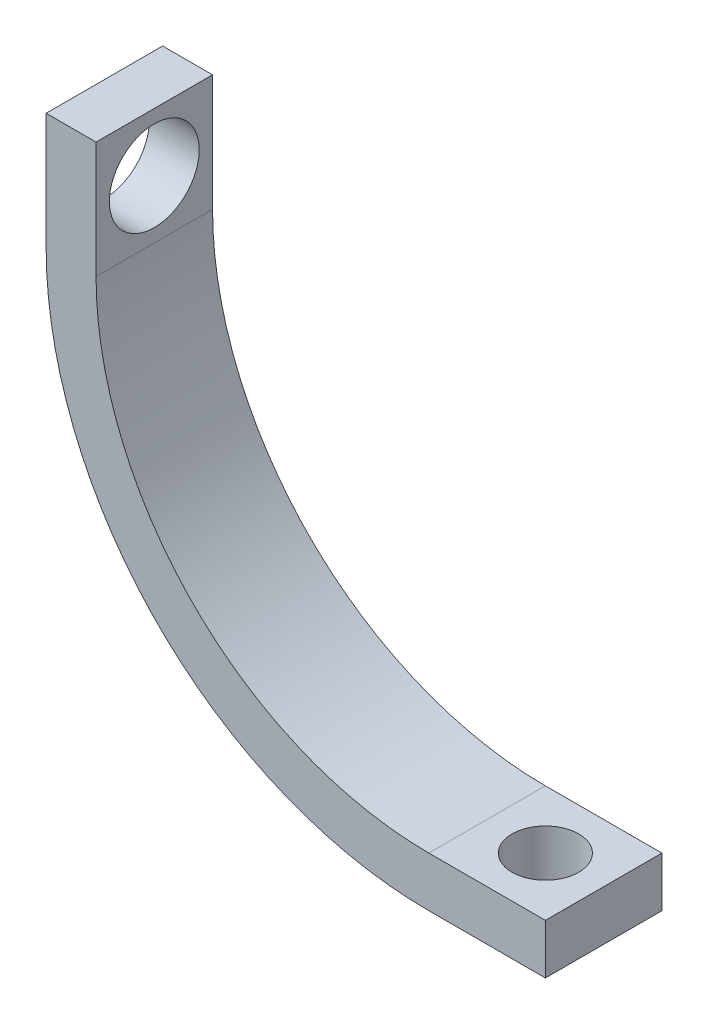
ISO-10303-21;
HEADER;
FILE_DESCRIPTION(('STEP AP214'),'2;1');
FILE_NAME('part.step','',(''),(''),'','','');
FILE_SCHEMA(('AUTOMOTIVE_DESIGN { 1 0 10303 214 1 1 1 1 }'));
ENDSEC;
DATA;
#1=APPLICATION_CONTEXT('core data for automotive mechanical design processes');
#2=APPLICATION_PROTOCOL_DEFINITION('international standard','automotive_design',2000,#1);
#3=PRODUCT_CONTEXT('',#1,'mechanical');
#4=PRODUCT('Part','Part','',(#3));
#5=PRODUCT_RELATED_PRODUCT_CATEGORY('part','',(#4));
#6=PRODUCT_DEFINITION_FORMATION('','',#4);
#7=PRODUCT_DEFINITION_CONTEXT('part definition',#1,'design');
#8=PRODUCT_DEFINITION('design','',#6,#7);
#9=PRODUCT_DEFINITION_SHAPE('','',#8);
#10=(LENGTH_UNIT() NAMED_UNIT(*) SI_UNIT(.MILLI.,.METRE.));
#11=(NAMED_UNIT(*) PLANE_ANGLE_UNIT() SI_UNIT($,.RADIAN.));
#12=(NAMED_UNIT(*) SI_UNIT($,.STERADIAN.) SOLID_ANGLE_UNIT());
#13=UNCERTAINTY_MEASURE_WITH_UNIT(LENGTH_MEASURE(1.E-05),#10,'distance_accuracy_value','');
#14=(GEOMETRIC_REPRESENTATION_CONTEXT(3) GLOBAL_UNCERTAINTY_ASSIGNED_CONTEXT((#13)) GLOBAL_UNIT_ASSIGNED_CONTEXT((#10,
#11,#12)) REPRESENTATION_CONTEXT('',''));
#15=CARTESIAN_POINT('',(0.,0.,0.));
#16=DIRECTION('',(0.,0.,1.));
#17=DIRECTION('',(1.,0.,0.));
#18=AXIS2_PLACEMENT_3D('',#15,#16,#17);
#19=CARTESIAN_POINT('',(0.,0.,7.));
#20=DIRECTION('',(0.,0.,-1.));
#21=DIRECTION('',(-1.,0.,0.));
#22=AXIS2_PLACEMENT_3D('',#19,#20,#21);
#23=CYLINDRICAL_SURFACE('',#22,20.);
#24=CARTESIAN_POINT('',(0.,0.,0.));
#25=DIRECTION('',(0.,0.,-1.));
#26=DIRECTION('',(1.,0.,0.));
#27=AXIS2_PLACEMENT_3D('',#24,#25,#26);
#28=CIRCLE('',#27,20.);
#29=CARTESIAN_POINT('',(0.,-20.,0.));
#30=VERTEX_POINT('',#29);
#31=CARTESIAN_POINT('',(-20.,0.,0.));
#32=VERTEX_POINT('',#31);
#33=EDGE_CURVE('E128',#30,#32,#28,.T.);
#34=ORIENTED_EDGE('',*,*,#33,.T.);
#35=DIRECTION('',(0.,0.,-1.));
#36=VECTOR('',#35,1.);
#37=CARTESIAN_POINT('',(-20.,0.,7.));
#38=LINE('',#37,#36);
#39=CARTESIAN_POINT('',(-20.,0.,7.));
#40=VERTEX_POINT('',#39);
#41=EDGE_CURVE('E11',#40,#32,#38,.T.);
#42=ORIENTED_EDGE('',*,*,#41,.F.);
#43=CARTESIAN_POINT('',(0.,0.,7.));
#44=DIRECTION('',(0.,0.,-1.));
#45=DIRECTION('',(1.,0.,0.));
#46=AXIS2_PLACEMENT_3D('',#43,#44,#45);
#47=CIRCLE('',#46,20.);
#48=CARTESIAN_POINT('',(0.,-20.,7.));
#49=VERTEX_POINT('',#48);
#50=EDGE_CURVE('E143',#49,#40,#47,.T.);
#51=ORIENTED_EDGE('',*,*,#50,.F.);
#52=DIRECTION('',(0.,0.,-1.));
#53=VECTOR('',#52,1.);
#54=CARTESIAN_POINT('',(0.,-20.,7.));
#55=LINE('',#54,#53);
#56=EDGE_CURVE('E124',#49,#30,#55,.T.);
#57=ORIENTED_EDGE('',*,*,#56,.T.);
#58=EDGE_LOOP('',(#34,#42,#51,#57));
#59=FACE_BOUND('',#58,.T.);
#60=ADVANCED_FACE('F32',(#59),#23,.F.);
#61=CARTESIAN_POINT('',(-20.,0.,7.));
#62=DIRECTION('',(-1.,0.,0.));
#63=DIRECTION('',(0.,0.,1.));
#64=AXIS2_PLACEMENT_3D('',#61,#62,#63);
#65=PLANE('',#64);
#66=CARTESIAN_POINT('',(-20.,3.5,3.5));
#67=DIRECTION('',(1.,0.,0.));
#68=DIRECTION('',(0.,0.,-1.));
#69=AXIS2_PLACEMENT_3D('',#66,#67,#68);
#70=CIRCLE('',#69,2.7);
#71=CARTESIAN_POINT('',(-20.,3.5,0.8));
#72=VERTEX_POINT('',#71);
#73=EDGE_CURVE('E176',#72,#72,#70,.T.);
#74=ORIENTED_EDGE('',*,*,#73,.F.);
#75=EDGE_LOOP('',(#74));
#76=FACE_BOUND('',#75,.T.);
#77=DIRECTION('',(0.,1.,0.));
#78=VECTOR('',#77,1.);
#79=CARTESIAN_POINT('',(-20.,0.,0.));
#80=LINE('',#79,#78);
#81=CARTESIAN_POINT('',(-20.,7.,0.));
#82=VERTEX_POINT('',#81);
#83=EDGE_CURVE('E131',#32,#82,#80,.T.);
#84=ORIENTED_EDGE('',*,*,#83,.T.);
#85=DIRECTION('',(0.,0.,-1.));
#86=VECTOR('',#85,1.);
#87=CARTESIAN_POINT('',(-20.,7.,7.));
#88=LINE('',#87,#86);
#89=CARTESIAN_POINT('',(-20.,7.,7.));
#90=VERTEX_POINT('',#89);
#91=EDGE_CURVE('E40',#90,#82,#88,.T.);
#92=ORIENTED_EDGE('',*,*,#91,.F.);
#93=DIRECTION('',(0.,1.,0.));
#94=VECTOR('',#93,1.);
#95=CARTESIAN_POINT('',(-20.,0.,7.));
#96=LINE('',#95,#94);
#97=EDGE_CURVE('E91',#40,#90,#96,.T.);
#98=ORIENTED_EDGE('',*,*,#97,.F.);
#99=ORIENTED_EDGE('',*,*,#41,.T.);
#100=EDGE_LOOP('',(#84,#92,#98,#99));
#101=FACE_BOUND('',#100,.T.);
#102=ADVANCED_FACE('F202',(#76,#101),#65,.F.);
#103=CARTESIAN_POINT('',(-20.,7.,7.));
#104=DIRECTION('',(0.,-1.,0.));
#105=DIRECTION('',(0.,0.,-1.));
#106=AXIS2_PLACEMENT_3D('',#103,#104,#105);
#107=PLANE('',#106);
#108=DIRECTION('',(-1.,0.,0.));
#109=VECTOR('',#108,1.);
#110=CARTESIAN_POINT('',(-20.,7.,0.));
#111=LINE('',#110,#109);
#112=CARTESIAN_POINT('',(-23.,7.,0.));
#113=VERTEX_POINT('',#112);
#114=EDGE_CURVE('E134',#82,#113,#111,.T.);
#115=ORIENTED_EDGE('',*,*,#114,.T.);
#116=DIRECTION('',(0.,0.,-1.));
#117=VECTOR('',#116,1.);
#118=CARTESIAN_POINT('',(-23.,7.,7.));
#119=LINE('',#118,#117);
#120=CARTESIAN_POINT('',(-23.,7.,7.));
#121=VERTEX_POINT('',#120);
#122=EDGE_CURVE('E150',#121,#113,#119,.T.);
#123=ORIENTED_EDGE('',*,*,#122,.F.);
#124=DIRECTION('',(-1.,0.,0.));
#125=VECTOR('',#124,1.);
#126=CARTESIAN_POINT('',(-20.,7.,7.));
#127=LINE('',#126,#125);
#128=EDGE_CURVE('E158',#90,#121,#127,.T.);
#129=ORIENTED_EDGE('',*,*,#128,.F.);
#130=ORIENTED_EDGE('',*,*,#91,.T.);
#131=EDGE_LOOP('',(#115,#123,#129,#130));
#132=FACE_BOUND('',#131,.T.);
#133=ADVANCED_FACE('F156',(#132),#107,.F.);
#134=CARTESIAN_POINT('',(-23.,0.,7.));
#135=DIRECTION('',(1.,0.,0.));
#136=DIRECTION('',(0.,0.,-1.));
#137=AXIS2_PLACEMENT_3D('',#134,#135,#136);
#138=PLANE('',#137);
#139=CARTESIAN_POINT('',(-23.,3.5,3.5));
#140=DIRECTION('',(1.,0.,0.));
#141=DIRECTION('',(0.,0.,-1.));
#142=AXIS2_PLACEMENT_3D('',#139,#140,#141);
#143=CIRCLE('',#142,2.7);
#144=CARTESIAN_POINT('',(-23.,3.5,0.8));
#145=VERTEX_POINT('',#144);
#146=EDGE_CURVE('E132',#145,#145,#143,.T.);
#147=ORIENTED_EDGE('',*,*,#146,.T.);
#148=EDGE_LOOP('',(#147));
#149=FACE_BOUND('',#148,.T.);
#150=DIRECTION('',(0.,-1.,0.));
#151=VECTOR('',#150,1.);
#152=CARTESIAN_POINT('',(-23.,0.,0.));
#153=LINE('',#152,#151);
#154=CARTESIAN_POINT('',(-23.,0.,0.));
#155=VERTEX_POINT('',#154);
#156=EDGE_CURVE('E136',#113,#155,#153,.T.);
#157=ORIENTED_EDGE('',*,*,#156,.T.);
#158=DIRECTION('',(0.,0.,-1.));
#159=VECTOR('',#158,1.);
#160=CARTESIAN_POINT('',(-23.,0.,7.));
#161=LINE('',#160,#159);
#162=CARTESIAN_POINT('',(-23.,0.,7.));
#163=VERTEX_POINT('',#162);
#164=EDGE_CURVE('E147',#163,#155,#161,.T.);
#165=ORIENTED_EDGE('',*,*,#164,.F.);
#166=DIRECTION('',(0.,-1.,0.));
#167=VECTOR('',#166,1.);
#168=CARTESIAN_POINT('',(-23.,0.,7.));
#169=LINE('',#168,#167);
#170=EDGE_CURVE('E170',#121,#163,#169,.T.);
#171=ORIENTED_EDGE('',*,*,#170,.F.);
#172=ORIENTED_EDGE('',*,*,#122,.T.);
#173=EDGE_LOOP('',(#157,#165,#171,#172));
#174=FACE_BOUND('',#173,.T.);
#175=ADVANCED_FACE('F166',(#149,#174),#138,.F.);
#176=CARTESIAN_POINT('',(0.,0.,7.));
#177=DIRECTION('',(0.,0.,-1.));
#178=DIRECTION('',(-1.,0.,0.));
#179=AXIS2_PLACEMENT_3D('',#176,#177,#178);
#180=CYLINDRICAL_SURFACE('',#179,23.);
#181=CARTESIAN_POINT('',(0.,0.,0.));
#182=DIRECTION('',(0.,0.,1.));
#183=DIRECTION('',(1.,0.,0.));
#184=AXIS2_PLACEMENT_3D('',#181,#182,#183);
#185=CIRCLE('',#184,23.);
#186=CARTESIAN_POINT('',(0.,-23.,0.));
#187=VERTEX_POINT('',#186);
#188=EDGE_CURVE('E138',#155,#187,#185,.T.);
#189=ORIENTED_EDGE('',*,*,#188,.T.);
#190=DIRECTION('',(0.,0.,-1.));
#191=VECTOR('',#190,1.);
#192=CARTESIAN_POINT('',(0.,-23.,7.));
#193=LINE('',#192,#191);
#194=CARTESIAN_POINT('',(0.,-23.,7.));
#195=VERTEX_POINT('',#194);
#196=EDGE_CURVE('E119',#195,#187,#193,.T.);
#197=ORIENTED_EDGE('',*,*,#196,.F.);
#198=CARTESIAN_POINT('',(0.,0.,7.));
#199=DIRECTION('',(0.,0.,1.));
#200=DIRECTION('',(1.,0.,0.));
#201=AXIS2_PLACEMENT_3D('',#198,#199,#200);
#202=CIRCLE('',#201,23.);
#203=EDGE_CURVE('E110',#163,#195,#202,.T.);
#204=ORIENTED_EDGE('',*,*,#203,.F.);
#205=ORIENTED_EDGE('',*,*,#164,.T.);
#206=EDGE_LOOP('',(#189,#197,#204,#205));
#207=FACE_BOUND('',#206,.T.);
#208=ADVANCED_FACE('F169',(#207),#180,.T.);
#209=CARTESIAN_POINT('',(0.,-23.,7.));
#210=DIRECTION('',(0.,1.,0.));
#211=DIRECTION('',(0.,0.,1.));
#212=AXIS2_PLACEMENT_3D('',#209,#210,#211);
#213=PLANE('',#212);
#214=CARTESIAN_POINT('',(3.50000000000004,-23.,3.5));
#215=DIRECTION('',(0.,1.,0.));
#216=DIRECTION('',(0.,0.,1.));
#217=AXIS2_PLACEMENT_3D('',#214,#215,#216);
#218=CIRCLE('',#217,2.);
#219=CARTESIAN_POINT('',(3.50000000000004,-23.,5.5));
#220=VERTEX_POINT('',#219);
#221=EDGE_CURVE('E179',#220,#220,#218,.T.);
#222=ORIENTED_EDGE('',*,*,#221,.T.);
#223=EDGE_LOOP('',(#222));
#224=FACE_BOUND('',#223,.T.);
#225=DIRECTION('',(1.,0.,0.));
#226=VECTOR('',#225,1.);
#227=CARTESIAN_POINT('',(0.,-23.,0.));
#228=LINE('',#227,#226);
#229=CARTESIAN_POINT('',(7.,-23.,0.));
#230=VERTEX_POINT('',#229);
#231=EDGE_CURVE('E118',#187,#230,#228,.T.);
#232=ORIENTED_EDGE('',*,*,#231,.T.);
#233=DIRECTION('',(0.,0.,-1.));
#234=VECTOR('',#233,1.);
#235=CARTESIAN_POINT('',(7.,-23.,7.));
#236=LINE('',#235,#234);
#237=CARTESIAN_POINT('',(7.,-23.,7.));
#238=VERTEX_POINT('',#237);
#239=EDGE_CURVE('E115',#238,#230,#236,.T.);
#240=ORIENTED_EDGE('',*,*,#239,.F.);
#241=DIRECTION('',(1.,0.,0.));
#242=VECTOR('',#241,1.);
#243=CARTESIAN_POINT('',(0.,-23.,7.));
#244=LINE('',#243,#242);
#245=EDGE_CURVE('E104',#195,#238,#244,.T.);
#246=ORIENTED_EDGE('',*,*,#245,.F.);
#247=ORIENTED_EDGE('',*,*,#196,.T.);
#248=EDGE_LOOP('',(#232,#240,#246,#247));
#249=FACE_BOUND('',#248,.T.);
#250=ADVANCED_FACE('F116',(#224,#249),#213,.F.);
#251=CARTESIAN_POINT('',(7.,-20.,7.));
#252=DIRECTION('',(-1.,0.,0.));
#253=DIRECTION('',(0.,0.,1.));
#254=AXIS2_PLACEMENT_3D('',#251,#252,#253);
#255=PLANE('',#254);
#256=DIRECTION('',(0.,1.,0.));
#257=VECTOR('',#256,1.);
#258=CARTESIAN_POINT('',(7.,-20.,0.));
#259=LINE('',#258,#257);
#260=CARTESIAN_POINT('',(7.,-20.,0.));
#261=VERTEX_POINT('',#260);
#262=EDGE_CURVE('E77',#230,#261,#259,.T.);
#263=ORIENTED_EDGE('',*,*,#262,.T.);
#264=DIRECTION('',(0.,0.,-1.));
#265=VECTOR('',#264,1.);
#266=CARTESIAN_POINT('',(7.,-20.,7.));
#267=LINE('',#266,#265);
#268=CARTESIAN_POINT('',(7.,-20.,7.));
#269=VERTEX_POINT('',#268);
#270=EDGE_CURVE('E120',#269,#261,#267,.T.);
#271=ORIENTED_EDGE('',*,*,#270,.F.);
#272=DIRECTION('',(0.,1.,0.));
#273=VECTOR('',#272,1.);
#274=CARTESIAN_POINT('',(7.,-20.,7.));
#275=LINE('',#274,#273);
#276=EDGE_CURVE('E108',#238,#269,#275,.T.);
#277=ORIENTED_EDGE('',*,*,#276,.F.);
#278=ORIENTED_EDGE('',*,*,#239,.T.);
#279=EDGE_LOOP('',(#263,#271,#277,#278));
#280=FACE_BOUND('',#279,.T.);
#281=ADVANCED_FACE('F122',(#280),#255,.F.);
#282=CARTESIAN_POINT('',(0.,-20.,7.));
#283=DIRECTION('',(0.,-1.,0.));
#284=DIRECTION('',(0.,0.,-1.));
#285=AXIS2_PLACEMENT_3D('',#282,#283,#284);
#286=PLANE('',#285);
#287=CARTESIAN_POINT('',(3.50000000000004,-20.,3.5));
#288=DIRECTION('',(0.,1.,0.));
#289=DIRECTION('',(0.,0.,1.));
#290=AXIS2_PLACEMENT_3D('',#287,#288,#289);
#291=CIRCLE('',#290,2.);
#292=CARTESIAN_POINT('',(3.50000000000004,-20.,5.5));
#293=VERTEX_POINT('',#292);
#294=EDGE_CURVE('E184',#293,#293,#291,.T.);
#295=ORIENTED_EDGE('',*,*,#294,.F.);
#296=EDGE_LOOP('',(#295));
#297=FACE_BOUND('',#296,.T.);
#298=DIRECTION('',(-1.,0.,0.));
#299=VECTOR('',#298,1.);
#300=CARTESIAN_POINT('',(0.,-20.,0.));
#301=LINE('',#300,#299);
#302=EDGE_CURVE('E83',#261,#30,#301,.T.);
#303=ORIENTED_EDGE('',*,*,#302,.T.);
#304=ORIENTED_EDGE('',*,*,#56,.F.);
#305=DIRECTION('',(-1.,0.,0.));
#306=VECTOR('',#305,1.);
#307=CARTESIAN_POINT('',(0.,-20.,7.));
#308=LINE('',#307,#306);
#309=EDGE_CURVE('E48',#269,#49,#308,.T.);
#310=ORIENTED_EDGE('',*,*,#309,.F.);
#311=ORIENTED_EDGE('',*,*,#270,.T.);
#312=EDGE_LOOP('',(#303,#304,#310,#311));
#313=FACE_BOUND('',#312,.T.);
#314=ADVANCED_FACE('F191',(#297,#313),#286,.F.);
#315=CARTESIAN_POINT('',(0.,0.,7.));
#316=DIRECTION('',(0.,0.,1.));
#317=DIRECTION('',(1.,0.,0.));
#318=AXIS2_PLACEMENT_3D('',#315,#316,#317);
#319=PLANE('',#318);
#320=ORIENTED_EDGE('',*,*,#50,.T.);
#321=ORIENTED_EDGE('',*,*,#97,.T.);
#322=ORIENTED_EDGE('',*,*,#128,.T.);
#323=ORIENTED_EDGE('',*,*,#170,.T.);
#324=ORIENTED_EDGE('',*,*,#203,.T.);
#325=ORIENTED_EDGE('',*,*,#245,.T.);
#326=ORIENTED_EDGE('',*,*,#276,.T.);
#327=ORIENTED_EDGE('',*,*,#309,.T.);
#328=EDGE_LOOP('',(#320,#321,#322,#323,#324,#325,#326,#327));
#329=FACE_BOUND('',#328,.T.);
#330=ADVANCED_FACE('F106',(#329),#319,.T.);
#331=CARTESIAN_POINT('',(0.,0.,0.));
#332=DIRECTION('',(0.,0.,1.));
#333=DIRECTION('',(1.,0.,0.));
#334=AXIS2_PLACEMENT_3D('',#331,#332,#333);
#335=PLANE('',#334);
#336=ORIENTED_EDGE('',*,*,#33,.F.);
#337=ORIENTED_EDGE('',*,*,#302,.F.);
#338=ORIENTED_EDGE('',*,*,#262,.F.);
#339=ORIENTED_EDGE('',*,*,#231,.F.);
#340=ORIENTED_EDGE('',*,*,#188,.F.);
#341=ORIENTED_EDGE('',*,*,#156,.F.);
#342=ORIENTED_EDGE('',*,*,#114,.F.);
#343=ORIENTED_EDGE('',*,*,#83,.F.);
#344=EDGE_LOOP('',(#336,#337,#338,#339,#340,#341,#342,#343));
#345=FACE_BOUND('',#344,.T.);
#346=ADVANCED_FACE('F162',(#345),#335,.F.);
#347=CARTESIAN_POINT('',(-23.,3.5,3.5));
#348=DIRECTION('',(1.,0.,0.));
#349=DIRECTION('',(0.,0.,-1.));
#350=AXIS2_PLACEMENT_3D('',#347,#348,#349);
#351=CYLINDRICAL_SURFACE('',#350,2.7);
#352=ORIENTED_EDGE('',*,*,#146,.F.);
#353=EDGE_LOOP('',(#352));
#354=FACE_BOUND('',#353,.T.);
#355=ORIENTED_EDGE('',*,*,#73,.T.);
#356=EDGE_LOOP('',(#355));
#357=FACE_BOUND('',#356,.T.);
#358=ADVANCED_FACE('F227',(#354,#357),#351,.F.);
#359=CARTESIAN_POINT('',(3.50000000000004,-30.,3.5));
#360=DIRECTION('',(0.,1.,0.));
#361=DIRECTION('',(0.,0.,1.));
#362=AXIS2_PLACEMENT_3D('',#359,#360,#361);
#363=CYLINDRICAL_SURFACE('',#362,2.);
#364=ORIENTED_EDGE('',*,*,#294,.T.);
#365=EDGE_LOOP('',(#364));
#366=FACE_BOUND('',#365,.T.);
#367=ORIENTED_EDGE('',*,*,#221,.F.);
#368=EDGE_LOOP('',(#367));
#369=FACE_BOUND('',#368,.T.);
#370=ADVANCED_FACE('F188',(#366,#369),#363,.F.);
#371=CLOSED_SHELL('',(#60,#102,#133,#175,#208,#250,#281,#314,#330,#346,#358,#370));
#372=MANIFOLD_SOLID_BREP('B2',#371);
#373=ADVANCED_BREP_SHAPE_REPRESENTATION('',(#18,#372),#14);
#374=SHAPE_DEFINITION_REPRESENTATION(#9,#373);
ENDSEC;
END-ISO-10303-21;
